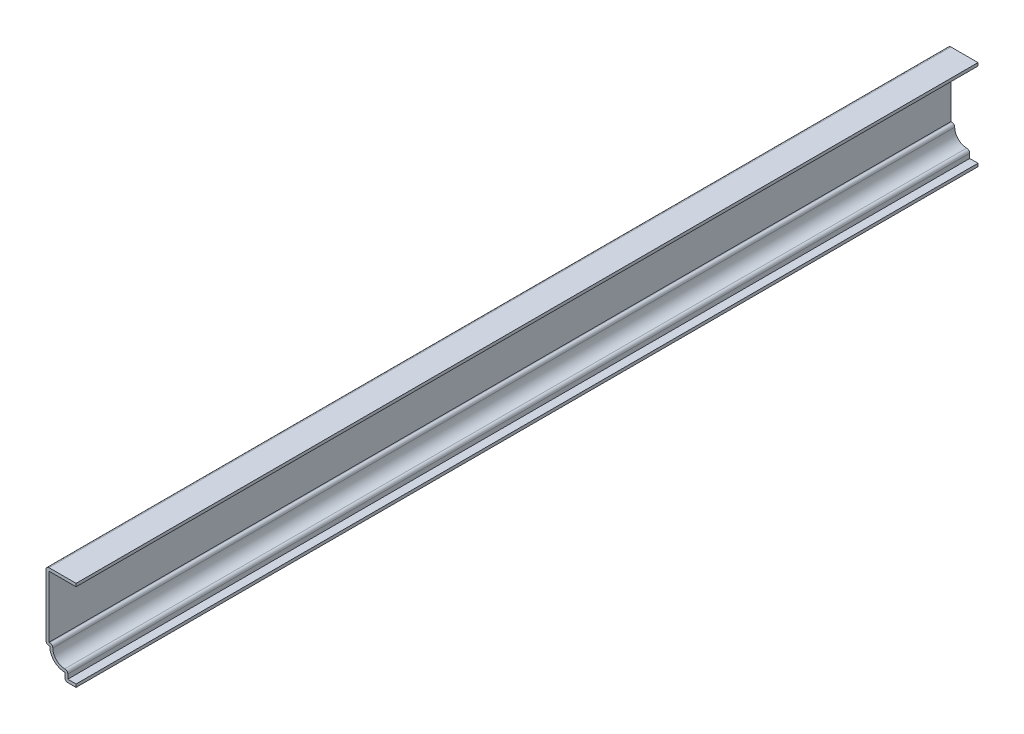
ISO-10303-21;
HEADER;
FILE_DESCRIPTION(('STEP AP214'),'2;1');
FILE_NAME('part.step','',(''),(''),'','','');
FILE_SCHEMA(('AUTOMOTIVE_DESIGN { 1 0 10303 214 1 1 1 1 }'));
ENDSEC;
DATA;
#1=APPLICATION_CONTEXT('core data for automotive mechanical design processes');
#2=APPLICATION_PROTOCOL_DEFINITION('international standard','automotive_design',2000,#1);
#3=PRODUCT_CONTEXT('',#1,'mechanical');
#4=PRODUCT('Part','Part','',(#3));
#5=PRODUCT_RELATED_PRODUCT_CATEGORY('part','',(#4));
#6=PRODUCT_DEFINITION_FORMATION('','',#4);
#7=PRODUCT_DEFINITION_CONTEXT('part definition',#1,'design');
#8=PRODUCT_DEFINITION('design','',#6,#7);
#9=PRODUCT_DEFINITION_SHAPE('','',#8);
#10=(LENGTH_UNIT() NAMED_UNIT(*) SI_UNIT(.MILLI.,.METRE.));
#11=(NAMED_UNIT(*) PLANE_ANGLE_UNIT() SI_UNIT($,.RADIAN.));
#12=(NAMED_UNIT(*) SI_UNIT($,.STERADIAN.) SOLID_ANGLE_UNIT());
#13=UNCERTAINTY_MEASURE_WITH_UNIT(LENGTH_MEASURE(1.E-05),#10,'distance_accuracy_value','');
#14=(GEOMETRIC_REPRESENTATION_CONTEXT(3) GLOBAL_UNCERTAINTY_ASSIGNED_CONTEXT((#13)) GLOBAL_UNIT_ASSIGNED_CONTEXT((#10,
#11,#12)) REPRESENTATION_CONTEXT('',''));
#15=CARTESIAN_POINT('',(0.,0.,0.));
#16=DIRECTION('',(0.,0.,1.));
#17=DIRECTION('',(1.,0.,0.));
#18=AXIS2_PLACEMENT_3D('',#15,#16,#17);
#19=CARTESIAN_POINT('',(-12.7,36.83,-381.));
#20=DIRECTION('',(0.,-1.,0.));
#21=DIRECTION('',(0.,0.,-1.));
#22=AXIS2_PLACEMENT_3D('',#19,#20,#21);
#23=PLANE('',#22);
#24=DIRECTION('',(1.,0.,0.));
#25=VECTOR('',#24,1.);
#26=CARTESIAN_POINT('',(-12.7,36.83,0.));
#27=LINE('',#26,#25);
#28=CARTESIAN_POINT('',(-11.43,36.83,0.));
#29=VERTEX_POINT('',#28);
#30=CARTESIAN_POINT('',(0.,36.83,0.));
#31=VERTEX_POINT('',#30);
#32=EDGE_CURVE('E248',#29,#31,#27,.T.);
#33=ORIENTED_EDGE('',*,*,#32,.F.);
#34=DIRECTION('',(0.,0.,1.));
#35=VECTOR('',#34,1.);
#36=CARTESIAN_POINT('',(-11.43,36.83,-381.));
#37=LINE('',#36,#35);
#38=CARTESIAN_POINT('',(-11.43,36.83,-381.));
#39=VERTEX_POINT('',#38);
#40=EDGE_CURVE('E202',#39,#29,#37,.T.);
#41=ORIENTED_EDGE('',*,*,#40,.F.);
#42=DIRECTION('',(1.,0.,0.));
#43=VECTOR('',#42,1.);
#44=CARTESIAN_POINT('',(-12.7,36.83,-381.));
#45=LINE('',#44,#43);
#46=CARTESIAN_POINT('',(0.,36.83,-381.));
#47=VERTEX_POINT('',#46);
#48=EDGE_CURVE('E181',#39,#47,#45,.T.);
#49=ORIENTED_EDGE('',*,*,#48,.T.);
#50=DIRECTION('',(0.,0.,1.));
#51=VECTOR('',#50,1.);
#52=CARTESIAN_POINT('',(0.,36.83,-381.));
#53=LINE('',#52,#51);
#54=EDGE_CURVE('E191',#47,#31,#53,.T.);
#55=ORIENTED_EDGE('',*,*,#54,.T.);
#56=EDGE_LOOP('',(#33,#41,#49,#55));
#57=FACE_BOUND('',#56,.T.);
#58=ADVANCED_FACE('F41',(#57),#23,.T.);
#59=CARTESIAN_POINT('',(-11.43,9.525,-381.));
#60=DIRECTION('',(1.,0.,0.));
#61=DIRECTION('',(0.,0.,-1.));
#62=AXIS2_PLACEMENT_3D('',#59,#60,#61);
#63=PLANE('',#62);
#64=DIRECTION('',(0.,1.,0.));
#65=VECTOR('',#64,1.);
#66=CARTESIAN_POINT('',(-11.43,9.525,0.));
#67=LINE('',#66,#65);
#68=CARTESIAN_POINT('',(-11.43,10.795,0.));
#69=VERTEX_POINT('',#68);
#70=EDGE_CURVE('E204',#69,#29,#67,.T.);
#71=ORIENTED_EDGE('',*,*,#70,.F.);
#72=DIRECTION('',(0.,0.,1.));
#73=VECTOR('',#72,1.);
#74=CARTESIAN_POINT('',(-11.43,10.795,-381.));
#75=LINE('',#74,#73);
#76=CARTESIAN_POINT('',(-11.43,10.795,-381.));
#77=VERTEX_POINT('',#76);
#78=EDGE_CURVE('E293',#77,#69,#75,.T.);
#79=ORIENTED_EDGE('',*,*,#78,.F.);
#80=DIRECTION('',(0.,1.,0.));
#81=VECTOR('',#80,1.);
#82=CARTESIAN_POINT('',(-11.43,9.525,-381.));
#83=LINE('',#82,#81);
#84=EDGE_CURVE('E200',#77,#39,#83,.T.);
#85=ORIENTED_EDGE('',*,*,#84,.T.);
#86=ORIENTED_EDGE('',*,*,#40,.T.);
#87=EDGE_LOOP('',(#71,#79,#85,#86));
#88=FACE_BOUND('',#87,.T.);
#89=ADVANCED_FACE('F441',(#88),#63,.T.);
#90=CARTESIAN_POINT('',(-11.1125,10.795,-381.));
#91=DIRECTION('',(0.,1.,0.));
#92=DIRECTION('',(-1.,0.,0.));
#93=AXIS2_PLACEMENT_3D('',#90,#91,#92);
#94=PLANE('',#93);
#95=DIRECTION('',(-1.,0.,0.));
#96=VECTOR('',#95,1.);
#97=CARTESIAN_POINT('',(-11.1125,10.795,0.));
#98=LINE('',#97,#96);
#99=CARTESIAN_POINT('',(-11.1125,10.795,0.));
#100=VERTEX_POINT('',#99);
#101=EDGE_CURVE('E208',#100,#69,#98,.T.);
#102=ORIENTED_EDGE('',*,*,#101,.F.);
#103=DIRECTION('',(0.,0.,1.));
#104=VECTOR('',#103,1.);
#105=CARTESIAN_POINT('',(-11.1125,10.795,-381.));
#106=LINE('',#105,#104);
#107=CARTESIAN_POINT('',(-11.1125,10.795,-381.));
#108=VERTEX_POINT('',#107);
#109=EDGE_CURVE('E50',#100,#108,#106,.F.);
#110=ORIENTED_EDGE('',*,*,#109,.T.);
#111=DIRECTION('',(-1.,0.,0.));
#112=VECTOR('',#111,1.);
#113=CARTESIAN_POINT('',(-11.1125,10.795,-381.));
#114=LINE('',#113,#112);
#115=EDGE_CURVE('E243',#108,#77,#114,.T.);
#116=ORIENTED_EDGE('',*,*,#115,.T.);
#117=ORIENTED_EDGE('',*,*,#78,.T.);
#118=EDGE_LOOP('',(#102,#110,#116,#117));
#119=FACE_BOUND('',#118,.T.);
#120=ADVANCED_FACE('F376',(#119),#94,.T.);
#121=CARTESIAN_POINT('',(-4.7625,9.525,-381.));
#122=DIRECTION('',(0.,0.,1.));
#123=DIRECTION('',(1.,0.,0.));
#124=AXIS2_PLACEMENT_3D('',#121,#122,#123);
#125=CYLINDRICAL_SURFACE('',#124,5.08);
#126=CARTESIAN_POINT('',(-4.7625,9.525,-381.));
#127=DIRECTION('',(0.,0.,1.));
#128=DIRECTION('',(1.,0.,0.));
#129=AXIS2_PLACEMENT_3D('',#126,#127,#128);
#130=CIRCLE('',#129,5.08);
#131=CARTESIAN_POINT('',(-4.7625,4.445,-381.));
#132=VERTEX_POINT('',#131);
#133=CARTESIAN_POINT('',(-9.8425,9.525,-381.));
#134=VERTEX_POINT('',#133);
#135=EDGE_CURVE('E239',#132,#134,#130,.F.);
#136=ORIENTED_EDGE('',*,*,#135,.T.);
#137=DIRECTION('',(0.,0.,1.));
#138=VECTOR('',#137,1.);
#139=CARTESIAN_POINT('',(-9.8425,9.525,-381.));
#140=LINE('',#139,#138);
#141=CARTESIAN_POINT('',(-9.8425,9.525,0.));
#142=VERTEX_POINT('',#141);
#143=EDGE_CURVE('E368',#134,#142,#140,.T.);
#144=ORIENTED_EDGE('',*,*,#143,.T.);
#145=CARTESIAN_POINT('',(-4.7625,9.525,0.));
#146=DIRECTION('',(0.,0.,1.));
#147=DIRECTION('',(1.,0.,0.));
#148=AXIS2_PLACEMENT_3D('',#145,#146,#147);
#149=CIRCLE('',#148,5.08);
#150=CARTESIAN_POINT('',(-4.7625,4.445,0.));
#151=VERTEX_POINT('',#150);
#152=EDGE_CURVE('E284',#151,#142,#149,.F.);
#153=ORIENTED_EDGE('',*,*,#152,.F.);
#154=DIRECTION('',(0.,0.,1.));
#155=VECTOR('',#154,1.);
#156=CARTESIAN_POINT('',(-4.7625,4.445,-381.));
#157=LINE('',#156,#155);
#158=EDGE_CURVE('E365',#151,#132,#157,.F.);
#159=ORIENTED_EDGE('',*,*,#158,.T.);
#160=EDGE_LOOP('',(#136,#144,#153,#159));
#161=FACE_BOUND('',#160,.T.);
#162=ADVANCED_FACE('F385',(#161),#125,.F.);
#163=CARTESIAN_POINT('',(-3.4925,0.,-381.));
#164=DIRECTION('',(1.,0.,0.));
#165=DIRECTION('',(0.,0.,-1.));
#166=AXIS2_PLACEMENT_3D('',#163,#164,#165);
#167=PLANE('',#166);
#168=DIRECTION('',(0.,1.,0.));
#169=VECTOR('',#168,1.);
#170=CARTESIAN_POINT('',(-3.4925,0.,-381.));
#171=LINE('',#170,#169);
#172=CARTESIAN_POINT('',(-3.4925,1.27,-381.));
#173=VERTEX_POINT('',#172);
#174=CARTESIAN_POINT('',(-3.4925,3.175,-381.));
#175=VERTEX_POINT('',#174);
#176=EDGE_CURVE('E235',#173,#175,#171,.T.);
#177=ORIENTED_EDGE('',*,*,#176,.T.);
#178=DIRECTION('',(0.,0.,1.));
#179=VECTOR('',#178,1.);
#180=CARTESIAN_POINT('',(-3.4925,3.175,-381.));
#181=LINE('',#180,#179);
#182=CARTESIAN_POINT('',(-3.4925,3.175,0.));
#183=VERTEX_POINT('',#182);
#184=EDGE_CURVE('E11',#175,#183,#181,.T.);
#185=ORIENTED_EDGE('',*,*,#184,.T.);
#186=DIRECTION('',(0.,1.,0.));
#187=VECTOR('',#186,1.);
#188=CARTESIAN_POINT('',(-3.4925,0.,0.));
#189=LINE('',#188,#187);
#190=CARTESIAN_POINT('',(-3.4925,1.27,0.));
#191=VERTEX_POINT('',#190);
#192=EDGE_CURVE('E280',#191,#183,#189,.T.);
#193=ORIENTED_EDGE('',*,*,#192,.F.);
#194=DIRECTION('',(0.,0.,1.));
#195=VECTOR('',#194,1.);
#196=CARTESIAN_POINT('',(-3.4925,1.27,-381.));
#197=LINE('',#196,#195);
#198=EDGE_CURVE('E297',#173,#191,#197,.T.);
#199=ORIENTED_EDGE('',*,*,#198,.F.);
#200=EDGE_LOOP('',(#177,#185,#193,#199));
#201=FACE_BOUND('',#200,.T.);
#202=ADVANCED_FACE('F395',(#201),#167,.T.);
#203=CARTESIAN_POINT('',(0.,1.27,-381.));
#204=DIRECTION('',(0.,1.,0.));
#205=DIRECTION('',(-1.,0.,0.));
#206=AXIS2_PLACEMENT_3D('',#203,#204,#205);
#207=PLANE('',#206);
#208=DIRECTION('',(-1.,0.,0.));
#209=VECTOR('',#208,1.);
#210=CARTESIAN_POINT('',(0.,1.27,0.));
#211=LINE('',#210,#209);
#212=CARTESIAN_POINT('',(0.,1.27,0.));
#213=VERTEX_POINT('',#212);
#214=EDGE_CURVE('E276',#213,#191,#211,.T.);
#215=ORIENTED_EDGE('',*,*,#214,.F.);
#216=DIRECTION('',(0.,0.,1.));
#217=VECTOR('',#216,1.);
#218=CARTESIAN_POINT('',(0.,1.27,-381.));
#219=LINE('',#218,#217);
#220=CARTESIAN_POINT('',(0.,1.27,-381.));
#221=VERTEX_POINT('',#220);
#222=EDGE_CURVE('E300',#221,#213,#219,.T.);
#223=ORIENTED_EDGE('',*,*,#222,.F.);
#224=DIRECTION('',(-1.,0.,0.));
#225=VECTOR('',#224,1.);
#226=CARTESIAN_POINT('',(0.,1.27,-381.));
#227=LINE('',#226,#225);
#228=EDGE_CURVE('E231',#221,#173,#227,.T.);
#229=ORIENTED_EDGE('',*,*,#228,.T.);
#230=ORIENTED_EDGE('',*,*,#198,.T.);
#231=EDGE_LOOP('',(#215,#223,#229,#230));
#232=FACE_BOUND('',#231,.T.);
#233=ADVANCED_FACE('F400',(#232),#207,.T.);
#234=CARTESIAN_POINT('',(0.,1.27,-381.));
#235=DIRECTION('',(-1.,0.,0.));
#236=DIRECTION('',(0.,-1.,0.));
#237=AXIS2_PLACEMENT_3D('',#234,#235,#236);
#238=PLANE('',#237);
#239=DIRECTION('',(0.,-1.,0.));
#240=VECTOR('',#239,1.);
#241=CARTESIAN_POINT('',(0.,1.27,0.));
#242=LINE('',#241,#240);
#243=CARTESIAN_POINT('',(0.,0.,0.));
#244=VERTEX_POINT('',#243);
#245=EDGE_CURVE('E273',#213,#244,#242,.T.);
#246=ORIENTED_EDGE('',*,*,#245,.T.);
#247=DIRECTION('',(0.,0.,1.));
#248=VECTOR('',#247,1.);
#249=CARTESIAN_POINT('',(0.,0.,-381.));
#250=LINE('',#249,#248);
#251=CARTESIAN_POINT('',(0.,0.,-381.));
#252=VERTEX_POINT('',#251);
#253=EDGE_CURVE('E303',#252,#244,#250,.T.);
#254=ORIENTED_EDGE('',*,*,#253,.F.);
#255=DIRECTION('',(0.,-1.,0.));
#256=VECTOR('',#255,1.);
#257=CARTESIAN_POINT('',(0.,1.27,-381.));
#258=LINE('',#257,#256);
#259=EDGE_CURVE('E228',#221,#252,#258,.T.);
#260=ORIENTED_EDGE('',*,*,#259,.F.);
#261=ORIENTED_EDGE('',*,*,#222,.T.);
#262=EDGE_LOOP('',(#246,#254,#260,#261));
#263=FACE_BOUND('',#262,.T.);
#264=ADVANCED_FACE('F405',(#263),#238,.F.);
#265=CARTESIAN_POINT('',(0.,0.,-381.));
#266=DIRECTION('',(0.,1.,0.));
#267=DIRECTION('',(-1.,0.,0.));
#268=AXIS2_PLACEMENT_3D('',#265,#266,#267);
#269=PLANE('',#268);
#270=DIRECTION('',(-1.,0.,0.));
#271=VECTOR('',#270,1.);
#272=CARTESIAN_POINT('',(0.,0.,0.));
#273=LINE('',#272,#271);
#274=CARTESIAN_POINT('',(-3.4925,0.,0.));
#275=VERTEX_POINT('',#274);
#276=EDGE_CURVE('E269',#244,#275,#273,.T.);
#277=ORIENTED_EDGE('',*,*,#276,.T.);
#278=DIRECTION('',(0.,0.,1.));
#279=VECTOR('',#278,1.);
#280=CARTESIAN_POINT('',(-3.4925,0.,-381.));
#281=LINE('',#280,#279);
#282=CARTESIAN_POINT('',(-3.4925,0.,-381.));
#283=VERTEX_POINT('',#282);
#284=EDGE_CURVE('E360',#275,#283,#281,.F.);
#285=ORIENTED_EDGE('',*,*,#284,.T.);
#286=DIRECTION('',(-1.,0.,0.));
#287=VECTOR('',#286,1.);
#288=CARTESIAN_POINT('',(0.,0.,-381.));
#289=LINE('',#288,#287);
#290=EDGE_CURVE('E225',#252,#283,#289,.T.);
#291=ORIENTED_EDGE('',*,*,#290,.F.);
#292=ORIENTED_EDGE('',*,*,#253,.T.);
#293=EDGE_LOOP('',(#277,#285,#291,#292));
#294=FACE_BOUND('',#293,.T.);
#295=ADVANCED_FACE('F461',(#294),#269,.F.);
#296=CARTESIAN_POINT('',(-4.7625,0.,-381.));
#297=DIRECTION('',(1.,0.,0.));
#298=DIRECTION('',(0.,0.,-1.));
#299=AXIS2_PLACEMENT_3D('',#296,#297,#298);
#300=PLANE('',#299);
#301=DIRECTION('',(0.,1.,0.));
#302=VECTOR('',#301,1.);
#303=CARTESIAN_POINT('',(-4.7625,0.,-381.));
#304=LINE('',#303,#302);
#305=CARTESIAN_POINT('',(-4.7625,1.27,-381.));
#306=VERTEX_POINT('',#305);
#307=CARTESIAN_POINT('',(-4.7625,3.175,-381.));
#308=VERTEX_POINT('',#307);
#309=EDGE_CURVE('E222',#306,#308,#304,.T.);
#310=ORIENTED_EDGE('',*,*,#309,.F.);
#311=DIRECTION('',(0.,0.,1.));
#312=VECTOR('',#311,1.);
#313=CARTESIAN_POINT('',(-4.7625,1.27,-381.));
#314=LINE('',#313,#312);
#315=CARTESIAN_POINT('',(-4.7625,1.27,0.));
#316=VERTEX_POINT('',#315);
#317=EDGE_CURVE('E356',#306,#316,#314,.T.);
#318=ORIENTED_EDGE('',*,*,#317,.T.);
#319=DIRECTION('',(0.,1.,0.));
#320=VECTOR('',#319,1.);
#321=CARTESIAN_POINT('',(-4.7625,0.,0.));
#322=LINE('',#321,#320);
#323=CARTESIAN_POINT('',(-4.7625,3.175,0.));
#324=VERTEX_POINT('',#323);
#325=EDGE_CURVE('E266',#316,#324,#322,.T.);
#326=ORIENTED_EDGE('',*,*,#325,.T.);
#327=DIRECTION('',(0.,0.,1.));
#328=VECTOR('',#327,1.);
#329=CARTESIAN_POINT('',(-4.7625,3.175,-381.));
#330=LINE('',#329,#328);
#331=EDGE_CURVE('E307',#308,#324,#330,.T.);
#332=ORIENTED_EDGE('',*,*,#331,.F.);
#333=EDGE_LOOP('',(#310,#318,#326,#332));
#334=FACE_BOUND('',#333,.T.);
#335=ADVANCED_FACE('F414',(#334),#300,.F.);
#336=CARTESIAN_POINT('',(-4.7625,9.525,-381.));
#337=DIRECTION('',(0.,0.,1.));
#338=DIRECTION('',(1.,0.,0.));
#339=AXIS2_PLACEMENT_3D('',#336,#337,#338);
#340=CYLINDRICAL_SURFACE('',#339,6.35);
#341=CARTESIAN_POINT('',(-4.7625,9.525,0.));
#342=DIRECTION('',(0.,0.,-1.));
#343=DIRECTION('',(-1.,0.,0.));
#344=AXIS2_PLACEMENT_3D('',#341,#342,#343);
#345=CIRCLE('',#344,6.35);
#346=CARTESIAN_POINT('',(-11.1125,9.525,0.));
#347=VERTEX_POINT('',#346);
#348=EDGE_CURVE('E263',#324,#347,#345,.T.);
#349=ORIENTED_EDGE('',*,*,#348,.T.);
#350=DIRECTION('',(0.,0.,1.));
#351=VECTOR('',#350,1.);
#352=CARTESIAN_POINT('',(-11.1125,9.525,-381.));
#353=LINE('',#352,#351);
#354=CARTESIAN_POINT('',(-11.1125,9.525,-381.));
#355=VERTEX_POINT('',#354);
#356=EDGE_CURVE('E311',#355,#347,#353,.T.);
#357=ORIENTED_EDGE('',*,*,#356,.F.);
#358=CARTESIAN_POINT('',(-4.7625,9.525,-381.));
#359=DIRECTION('',(0.,0.,-1.));
#360=DIRECTION('',(-1.,0.,0.));
#361=AXIS2_PLACEMENT_3D('',#358,#359,#360);
#362=CIRCLE('',#361,6.35);
#363=EDGE_CURVE('E219',#308,#355,#362,.T.);
#364=ORIENTED_EDGE('',*,*,#363,.F.);
#365=ORIENTED_EDGE('',*,*,#331,.T.);
#366=EDGE_LOOP('',(#349,#357,#364,#365));
#367=FACE_BOUND('',#366,.T.);
#368=ADVANCED_FACE('F421',(#367),#340,.T.);
#369=CARTESIAN_POINT('',(-11.1125,9.525,-381.));
#370=DIRECTION('',(0.,1.,0.));
#371=DIRECTION('',(-1.,0.,0.));
#372=AXIS2_PLACEMENT_3D('',#369,#370,#371);
#373=PLANE('',#372);
#374=DIRECTION('',(-1.,0.,0.));
#375=VECTOR('',#374,1.);
#376=CARTESIAN_POINT('',(-11.1125,9.525,0.));
#377=LINE('',#376,#375);
#378=CARTESIAN_POINT('',(-11.43,9.525,0.));
#379=VERTEX_POINT('',#378);
#380=EDGE_CURVE('E260',#347,#379,#377,.T.);
#381=ORIENTED_EDGE('',*,*,#380,.T.);
#382=DIRECTION('',(0.,0.,1.));
#383=VECTOR('',#382,1.);
#384=CARTESIAN_POINT('',(-11.43,9.525,-381.));
#385=LINE('',#384,#383);
#386=CARTESIAN_POINT('',(-11.43,9.525,-381.));
#387=VERTEX_POINT('',#386);
#388=EDGE_CURVE('E57',#379,#387,#385,.F.);
#389=ORIENTED_EDGE('',*,*,#388,.T.);
#390=DIRECTION('',(-1.,0.,0.));
#391=VECTOR('',#390,1.);
#392=CARTESIAN_POINT('',(-11.1125,9.525,-381.));
#393=LINE('',#392,#391);
#394=EDGE_CURVE('E216',#355,#387,#393,.T.);
#395=ORIENTED_EDGE('',*,*,#394,.F.);
#396=ORIENTED_EDGE('',*,*,#356,.T.);
#397=EDGE_LOOP('',(#381,#389,#395,#396));
#398=FACE_BOUND('',#397,.T.);
#399=ADVANCED_FACE('F423',(#398),#373,.F.);
#400=CARTESIAN_POINT('',(-12.7,9.525,-381.));
#401=DIRECTION('',(1.,0.,0.));
#402=DIRECTION('',(0.,0.,-1.));
#403=AXIS2_PLACEMENT_3D('',#400,#401,#402);
#404=PLANE('',#403);
#405=DIRECTION('',(0.,1.,0.));
#406=VECTOR('',#405,1.);
#407=CARTESIAN_POINT('',(-12.7,9.525,0.));
#408=LINE('',#407,#406);
#409=CARTESIAN_POINT('',(-12.7,10.795,0.));
#410=VERTEX_POINT('',#409);
#411=CARTESIAN_POINT('',(-12.7,36.83,0.));
#412=VERTEX_POINT('',#411);
#413=EDGE_CURVE('E256',#410,#412,#408,.T.);
#414=ORIENTED_EDGE('',*,*,#413,.T.);
#415=DIRECTION('',(0.,0.,1.));
#416=VECTOR('',#415,1.);
#417=CARTESIAN_POINT('',(-12.7,36.83,-381.));
#418=LINE('',#417,#416);
#419=CARTESIAN_POINT('',(-12.7,36.83,-381.));
#420=VERTEX_POINT('',#419);
#421=EDGE_CURVE('E339',#412,#420,#418,.F.);
#422=ORIENTED_EDGE('',*,*,#421,.T.);
#423=DIRECTION('',(0.,1.,0.));
#424=VECTOR('',#423,1.);
#425=CARTESIAN_POINT('',(-12.7,9.525,-381.));
#426=LINE('',#425,#424);
#427=CARTESIAN_POINT('',(-12.7,10.795,-381.));
#428=VERTEX_POINT('',#427);
#429=EDGE_CURVE('E213',#428,#420,#426,.T.);
#430=ORIENTED_EDGE('',*,*,#429,.F.);
#431=DIRECTION('',(0.,0.,1.));
#432=VECTOR('',#431,1.);
#433=CARTESIAN_POINT('',(-12.7,10.795,-381.));
#434=LINE('',#433,#432);
#435=EDGE_CURVE('E335',#428,#410,#434,.T.);
#436=ORIENTED_EDGE('',*,*,#435,.T.);
#437=EDGE_LOOP('',(#414,#422,#430,#436));
#438=FACE_BOUND('',#437,.T.);
#439=ADVANCED_FACE('F431',(#438),#404,.F.);
#440=CARTESIAN_POINT('',(-12.7,38.1,-381.));
#441=DIRECTION('',(0.,-1.,0.));
#442=DIRECTION('',(0.,0.,-1.));
#443=AXIS2_PLACEMENT_3D('',#440,#441,#442);
#444=PLANE('',#443);
#445=DIRECTION('',(1.,0.,0.));
#446=VECTOR('',#445,1.);
#447=CARTESIAN_POINT('',(-12.7,38.1,-381.));
#448=LINE('',#447,#446);
#449=CARTESIAN_POINT('',(-11.43,38.1,-381.));
#450=VERTEX_POINT('',#449);
#451=CARTESIAN_POINT('',(0.,38.1,-381.));
#452=VERTEX_POINT('',#451);
#453=EDGE_CURVE('E184',#450,#452,#448,.T.);
#454=ORIENTED_EDGE('',*,*,#453,.F.);
#455=DIRECTION('',(0.,0.,1.));
#456=VECTOR('',#455,1.);
#457=CARTESIAN_POINT('',(-11.43,38.1,-381.));
#458=LINE('',#457,#456);
#459=CARTESIAN_POINT('',(-11.43,38.1,0.));
#460=VERTEX_POINT('',#459);
#461=EDGE_CURVE('E292',#450,#460,#458,.T.);
#462=ORIENTED_EDGE('',*,*,#461,.T.);
#463=DIRECTION('',(1.,0.,0.));
#464=VECTOR('',#463,1.);
#465=CARTESIAN_POINT('',(-12.7,38.1,0.));
#466=LINE('',#465,#464);
#467=CARTESIAN_POINT('',(0.,38.1,0.));
#468=VERTEX_POINT('',#467);
#469=EDGE_CURVE('E253',#460,#468,#466,.T.);
#470=ORIENTED_EDGE('',*,*,#469,.T.);
#471=DIRECTION('',(0.,0.,1.));
#472=VECTOR('',#471,1.);
#473=CARTESIAN_POINT('',(0.,38.1,-381.));
#474=LINE('',#473,#472);
#475=EDGE_CURVE('E199',#452,#468,#474,.T.);
#476=ORIENTED_EDGE('',*,*,#475,.F.);
#477=EDGE_LOOP('',(#454,#462,#470,#476));
#478=FACE_BOUND('',#477,.T.);
#479=ADVANCED_FACE('F438',(#478),#444,.F.);
#480=CARTESIAN_POINT('',(0.,38.1,-381.));
#481=DIRECTION('',(-1.,0.,0.));
#482=DIRECTION('',(0.,0.,1.));
#483=AXIS2_PLACEMENT_3D('',#480,#481,#482);
#484=PLANE('',#483);
#485=DIRECTION('',(0.,-1.,0.));
#486=VECTOR('',#485,1.);
#487=CARTESIAN_POINT('',(0.,38.1,0.));
#488=LINE('',#487,#486);
#489=EDGE_CURVE('E194',#468,#31,#488,.T.);
#490=ORIENTED_EDGE('',*,*,#489,.T.);
#491=ORIENTED_EDGE('',*,*,#54,.F.);
#492=DIRECTION('',(0.,-1.,0.));
#493=VECTOR('',#492,1.);
#494=CARTESIAN_POINT('',(0.,38.1,-381.));
#495=LINE('',#494,#493);
#496=EDGE_CURVE('E175',#452,#47,#495,.T.);
#497=ORIENTED_EDGE('',*,*,#496,.F.);
#498=ORIENTED_EDGE('',*,*,#475,.T.);
#499=EDGE_LOOP('',(#490,#491,#497,#498));
#500=FACE_BOUND('',#499,.T.);
#501=ADVANCED_FACE('F192',(#500),#484,.F.);
#502=CARTESIAN_POINT('',(-4.7625,9.525,-381.));
#503=DIRECTION('',(0.,0.,-1.));
#504=DIRECTION('',(-1.,0.,0.));
#505=AXIS2_PLACEMENT_3D('',#502,#503,#504);
#506=PLANE('',#505);
#507=ORIENTED_EDGE('',*,*,#429,.T.);
#508=CARTESIAN_POINT('',(-11.43,36.83,-381.));
#509=DIRECTION('',(0.,0.,-1.));
#510=DIRECTION('',(-1.,0.,0.));
#511=AXIS2_PLACEMENT_3D('',#508,#509,#510);
#512=CIRCLE('',#511,1.27);
#513=EDGE_CURVE('E353',#420,#450,#512,.T.);
#514=ORIENTED_EDGE('',*,*,#513,.T.);
#515=ORIENTED_EDGE('',*,*,#453,.T.);
#516=ORIENTED_EDGE('',*,*,#496,.T.);
#517=ORIENTED_EDGE('',*,*,#48,.F.);
#518=ORIENTED_EDGE('',*,*,#84,.F.);
#519=ORIENTED_EDGE('',*,*,#115,.F.);
#520=CARTESIAN_POINT('',(-11.1125,9.525,-381.));
#521=DIRECTION('',(0.,0.,-1.));
#522=DIRECTION('',(-1.,0.,0.));
#523=AXIS2_PLACEMENT_3D('',#520,#521,#522);
#524=CIRCLE('',#523,1.27);
#525=EDGE_CURVE('E345',#108,#134,#524,.T.);
#526=ORIENTED_EDGE('',*,*,#525,.T.);
#527=ORIENTED_EDGE('',*,*,#135,.F.);
#528=CARTESIAN_POINT('',(-4.7625,3.175,-381.));
#529=DIRECTION('',(0.,0.,-1.));
#530=DIRECTION('',(-1.,0.,0.));
#531=AXIS2_PLACEMENT_3D('',#528,#529,#530);
#532=CIRCLE('',#531,1.27);
#533=EDGE_CURVE('E342',#132,#175,#532,.T.);
#534=ORIENTED_EDGE('',*,*,#533,.T.);
#535=ORIENTED_EDGE('',*,*,#176,.F.);
#536=ORIENTED_EDGE('',*,*,#228,.F.);
#537=ORIENTED_EDGE('',*,*,#259,.T.);
#538=ORIENTED_EDGE('',*,*,#290,.T.);
#539=CARTESIAN_POINT('',(-3.4925,1.27,-381.));
#540=DIRECTION('',(0.,0.,-1.));
#541=DIRECTION('',(-1.,0.,0.));
#542=AXIS2_PLACEMENT_3D('',#539,#540,#541);
#543=CIRCLE('',#542,1.27);
#544=EDGE_CURVE('E65',#283,#306,#543,.T.);
#545=ORIENTED_EDGE('',*,*,#544,.T.);
#546=ORIENTED_EDGE('',*,*,#309,.T.);
#547=ORIENTED_EDGE('',*,*,#363,.T.);
#548=ORIENTED_EDGE('',*,*,#394,.T.);
#549=CARTESIAN_POINT('',(-11.43,10.795,-381.));
#550=DIRECTION('',(0.,0.,-1.));
#551=DIRECTION('',(-1.,0.,0.));
#552=AXIS2_PLACEMENT_3D('',#549,#550,#551);
#553=CIRCLE('',#552,1.27);
#554=EDGE_CURVE('E348',#387,#428,#553,.T.);
#555=ORIENTED_EDGE('',*,*,#554,.T.);
#556=EDGE_LOOP('',(#507,#514,#515,#516,#517,#518,#519,#526,#527,#534,#535,#536,#537,#538,#545,
#546,#547,#548,#555));
#557=FACE_BOUND('',#556,.T.);
#558=ADVANCED_FACE('F178',(#557),#506,.T.);
#559=CARTESIAN_POINT('',(-4.7625,9.525,0.));
#560=DIRECTION('',(0.,0.,-1.));
#561=DIRECTION('',(-1.,0.,0.));
#562=AXIS2_PLACEMENT_3D('',#559,#560,#561);
#563=PLANE('',#562);
#564=ORIENTED_EDGE('',*,*,#469,.F.);
#565=CARTESIAN_POINT('',(-11.43,36.83,0.));
#566=DIRECTION('',(0.,0.,-1.));
#567=DIRECTION('',(-1.,0.,0.));
#568=AXIS2_PLACEMENT_3D('',#565,#566,#567);
#569=CIRCLE('',#568,1.27);
#570=EDGE_CURVE('E332',#460,#412,#569,.F.);
#571=ORIENTED_EDGE('',*,*,#570,.T.);
#572=ORIENTED_EDGE('',*,*,#413,.F.);
#573=CARTESIAN_POINT('',(-11.43,10.795,0.));
#574=DIRECTION('',(0.,0.,-1.));
#575=DIRECTION('',(-1.,0.,0.));
#576=AXIS2_PLACEMENT_3D('',#573,#574,#575);
#577=CIRCLE('',#576,1.27);
#578=EDGE_CURVE('E326',#410,#379,#577,.F.);
#579=ORIENTED_EDGE('',*,*,#578,.T.);
#580=ORIENTED_EDGE('',*,*,#380,.F.);
#581=ORIENTED_EDGE('',*,*,#348,.F.);
#582=ORIENTED_EDGE('',*,*,#325,.F.);
#583=CARTESIAN_POINT('',(-3.4925,1.27,0.));
#584=DIRECTION('',(0.,0.,-1.));
#585=DIRECTION('',(-1.,0.,0.));
#586=AXIS2_PLACEMENT_3D('',#583,#584,#585);
#587=CIRCLE('',#586,1.27);
#588=EDGE_CURVE('E329',#316,#275,#587,.F.);
#589=ORIENTED_EDGE('',*,*,#588,.T.);
#590=ORIENTED_EDGE('',*,*,#276,.F.);
#591=ORIENTED_EDGE('',*,*,#245,.F.);
#592=ORIENTED_EDGE('',*,*,#214,.T.);
#593=ORIENTED_EDGE('',*,*,#192,.T.);
#594=CARTESIAN_POINT('',(-4.7625,3.175,0.));
#595=DIRECTION('',(0.,0.,-1.));
#596=DIRECTION('',(-1.,0.,0.));
#597=AXIS2_PLACEMENT_3D('',#594,#595,#596);
#598=CIRCLE('',#597,1.27);
#599=EDGE_CURVE('E320',#183,#151,#598,.F.);
#600=ORIENTED_EDGE('',*,*,#599,.T.);
#601=ORIENTED_EDGE('',*,*,#152,.T.);
#602=CARTESIAN_POINT('',(-11.1125,9.525,0.));
#603=DIRECTION('',(0.,0.,-1.));
#604=DIRECTION('',(-1.,0.,0.));
#605=AXIS2_PLACEMENT_3D('',#602,#603,#604);
#606=CIRCLE('',#605,1.27);
#607=EDGE_CURVE('E323',#142,#100,#606,.F.);
#608=ORIENTED_EDGE('',*,*,#607,.T.);
#609=ORIENTED_EDGE('',*,*,#101,.T.);
#610=ORIENTED_EDGE('',*,*,#70,.T.);
#611=ORIENTED_EDGE('',*,*,#32,.T.);
#612=ORIENTED_EDGE('',*,*,#489,.F.);
#613=EDGE_LOOP('',(#564,#571,#572,#579,#580,#581,#582,#589,#590,#591,#592,#593,#600,#601,#608,
#609,#610,#611,#612));
#614=FACE_BOUND('',#613,.T.);
#615=ADVANCED_FACE('F389',(#614),#563,.F.);
#616=CARTESIAN_POINT('',(-11.43,36.83,-381.));
#617=DIRECTION('',(0.,0.,1.));
#618=DIRECTION('',(1.,0.,0.));
#619=AXIS2_PLACEMENT_3D('',#616,#617,#618);
#620=CYLINDRICAL_SURFACE('',#619,1.27);
#621=ORIENTED_EDGE('',*,*,#513,.F.);
#622=ORIENTED_EDGE('',*,*,#421,.F.);
#623=ORIENTED_EDGE('',*,*,#570,.F.);
#624=ORIENTED_EDGE('',*,*,#461,.F.);
#625=EDGE_LOOP('',(#621,#622,#623,#624));
#626=FACE_BOUND('',#625,.T.);
#627=ADVANCED_FACE('F436',(#626),#620,.T.);
#628=CARTESIAN_POINT('',(-3.4925,1.27,-381.));
#629=DIRECTION('',(0.,0.,1.));
#630=DIRECTION('',(1.,0.,0.));
#631=AXIS2_PLACEMENT_3D('',#628,#629,#630);
#632=CYLINDRICAL_SURFACE('',#631,1.27);
#633=ORIENTED_EDGE('',*,*,#544,.F.);
#634=ORIENTED_EDGE('',*,*,#284,.F.);
#635=ORIENTED_EDGE('',*,*,#588,.F.);
#636=ORIENTED_EDGE('',*,*,#317,.F.);
#637=EDGE_LOOP('',(#633,#634,#635,#636));
#638=FACE_BOUND('',#637,.T.);
#639=ADVANCED_FACE('F411',(#638),#632,.T.);
#640=CARTESIAN_POINT('',(-11.43,10.795,-381.));
#641=DIRECTION('',(0.,0.,1.));
#642=DIRECTION('',(1.,0.,0.));
#643=AXIS2_PLACEMENT_3D('',#640,#641,#642);
#644=CYLINDRICAL_SURFACE('',#643,1.27);
#645=ORIENTED_EDGE('',*,*,#554,.F.);
#646=ORIENTED_EDGE('',*,*,#388,.F.);
#647=ORIENTED_EDGE('',*,*,#578,.F.);
#648=ORIENTED_EDGE('',*,*,#435,.F.);
#649=EDGE_LOOP('',(#645,#646,#647,#648));
#650=FACE_BOUND('',#649,.T.);
#651=ADVANCED_FACE('F428',(#650),#644,.T.);
#652=CARTESIAN_POINT('',(-11.1125,9.525,-381.));
#653=DIRECTION('',(0.,0.,1.));
#654=DIRECTION('',(1.,0.,0.));
#655=AXIS2_PLACEMENT_3D('',#652,#653,#654);
#656=CYLINDRICAL_SURFACE('',#655,1.27);
#657=ORIENTED_EDGE('',*,*,#525,.F.);
#658=ORIENTED_EDGE('',*,*,#109,.F.);
#659=ORIENTED_EDGE('',*,*,#607,.F.);
#660=ORIENTED_EDGE('',*,*,#143,.F.);
#661=EDGE_LOOP('',(#657,#658,#659,#660));
#662=FACE_BOUND('',#661,.T.);
#663=ADVANCED_FACE('F382',(#662),#656,.T.);
#664=CARTESIAN_POINT('',(-4.7625,3.175,-381.));
#665=DIRECTION('',(0.,0.,1.));
#666=DIRECTION('',(1.,0.,0.));
#667=AXIS2_PLACEMENT_3D('',#664,#665,#666);
#668=CYLINDRICAL_SURFACE('',#667,1.27);
#669=ORIENTED_EDGE('',*,*,#533,.F.);
#670=ORIENTED_EDGE('',*,*,#158,.F.);
#671=ORIENTED_EDGE('',*,*,#599,.F.);
#672=ORIENTED_EDGE('',*,*,#184,.F.);
#673=EDGE_LOOP('',(#669,#670,#671,#672));
#674=FACE_BOUND('',#673,.T.);
#675=ADVANCED_FACE('F43',(#674),#668,.T.);
#676=CLOSED_SHELL('',(#58,#89,#120,#162,#202,#233,#264,#295,#335,#368,#399,#439,#479,#501,#558,
#615,#627,#639,#651,#663,#675));
#677=MANIFOLD_SOLID_BREP('B2',#676);
#678=ADVANCED_BREP_SHAPE_REPRESENTATION('',(#18,#677),#14);
#679=SHAPE_DEFINITION_REPRESENTATION(#9,#678);
ENDSEC;
END-ISO-10303-21;
